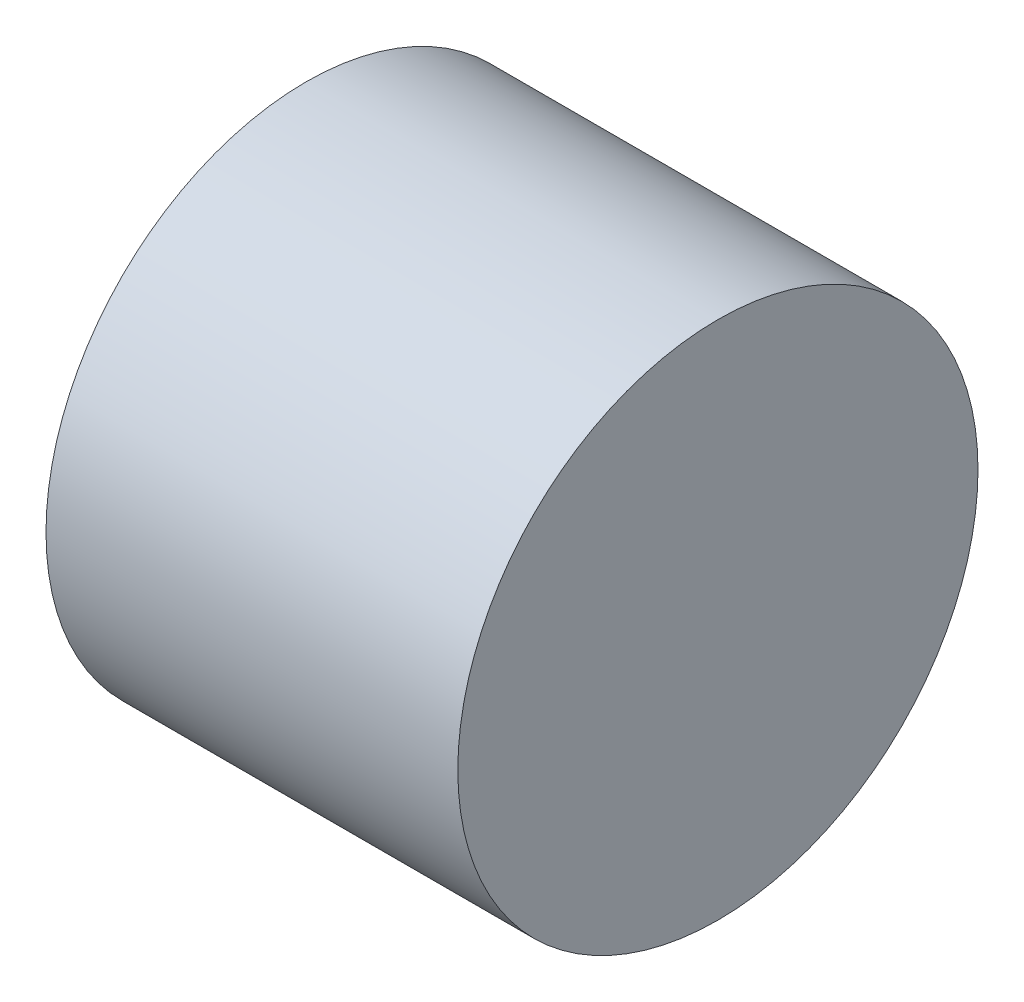
ISO-10303-21;
HEADER;
FILE_DESCRIPTION(('STEP AP214'),'2;1');
FILE_NAME('part.step','',(''),(''),'','','');
FILE_SCHEMA(('AUTOMOTIVE_DESIGN { 1 0 10303 214 1 1 1 1 }'));
ENDSEC;
DATA;
#1=APPLICATION_CONTEXT('core data for automotive mechanical design processes');
#2=APPLICATION_PROTOCOL_DEFINITION('international standard','automotive_design',2000,#1);
#3=PRODUCT_CONTEXT('',#1,'mechanical');
#4=PRODUCT('Part','Part','',(#3));
#5=PRODUCT_RELATED_PRODUCT_CATEGORY('part','',(#4));
#6=PRODUCT_DEFINITION_FORMATION('','',#4);
#7=PRODUCT_DEFINITION_CONTEXT('part definition',#1,'design');
#8=PRODUCT_DEFINITION('design','',#6,#7);
#9=PRODUCT_DEFINITION_SHAPE('','',#8);
#10=(LENGTH_UNIT() NAMED_UNIT(*) SI_UNIT(.MILLI.,.METRE.));
#11=(NAMED_UNIT(*) PLANE_ANGLE_UNIT() SI_UNIT($,.RADIAN.));
#12=(NAMED_UNIT(*) SI_UNIT($,.STERADIAN.) SOLID_ANGLE_UNIT());
#13=UNCERTAINTY_MEASURE_WITH_UNIT(LENGTH_MEASURE(1.E-05),#10,'distance_accuracy_value','');
#14=(GEOMETRIC_REPRESENTATION_CONTEXT(3) GLOBAL_UNCERTAINTY_ASSIGNED_CONTEXT((#13)) GLOBAL_UNIT_ASSIGNED_CONTEXT((#10,
#11,#12)) REPRESENTATION_CONTEXT('',''));
#15=CARTESIAN_POINT('',(0.,0.,0.));
#16=DIRECTION('',(0.,0.,1.));
#17=DIRECTION('',(1.,0.,0.));
#18=AXIS2_PLACEMENT_3D('',#15,#16,#17);
#19=CARTESIAN_POINT('',(125.4,0.,0.));
#20=DIRECTION('',(-1.,0.,0.));
#21=DIRECTION('',(0.,0.,1.));
#22=AXIS2_PLACEMENT_3D('',#19,#20,#21);
#23=CYLINDRICAL_SURFACE('',#22,152.4);
#24=CARTESIAN_POINT('',(125.4,0.,0.));
#25=DIRECTION('',(1.,0.,0.));
#26=DIRECTION('',(0.,0.,-1.));
#27=AXIS2_PLACEMENT_3D('',#24,#25,#26);
#28=CIRCLE('',#27,152.4);
#29=CARTESIAN_POINT('',(125.4,0.,-152.4));
#30=VERTEX_POINT('',#29);
#31=EDGE_CURVE('E10',#30,#30,#28,.T.);
#32=ORIENTED_EDGE('',*,*,#31,.F.);
#33=EDGE_LOOP('',(#32));
#34=FACE_BOUND('',#33,.T.);
#35=CARTESIAN_POINT('',(-115.9,0.,0.));
#36=DIRECTION('',(1.,0.,0.));
#37=DIRECTION('',(0.,0.,-1.));
#38=AXIS2_PLACEMENT_3D('',#35,#36,#37);
#39=CIRCLE('',#38,152.4);
#40=CARTESIAN_POINT('',(-115.9,0.,-152.4));
#41=VERTEX_POINT('',#40);
#42=EDGE_CURVE('E36',#41,#41,#39,.T.);
#43=ORIENTED_EDGE('',*,*,#42,.T.);
#44=EDGE_LOOP('',(#43));
#45=FACE_BOUND('',#44,.T.);
#46=ADVANCED_FACE('F33',(#34,#45),#23,.T.);
#47=CARTESIAN_POINT('',(125.4,0.,0.));
#48=DIRECTION('',(1.,0.,0.));
#49=DIRECTION('',(0.,0.,-1.));
#50=AXIS2_PLACEMENT_3D('',#47,#48,#49);
#51=PLANE('',#50);
#52=ORIENTED_EDGE('',*,*,#31,.T.);
#53=EDGE_LOOP('',(#52));
#54=FACE_BOUND('',#53,.T.);
#55=ADVANCED_FACE('F48',(#54),#51,.T.);
#56=CARTESIAN_POINT('',(-115.9,0.,0.));
#57=DIRECTION('',(1.,0.,0.));
#58=DIRECTION('',(0.,0.,-1.));
#59=AXIS2_PLACEMENT_3D('',#56,#57,#58);
#60=PLANE('',#59);
#61=ORIENTED_EDGE('',*,*,#42,.F.);
#62=EDGE_LOOP('',(#61));
#63=FACE_BOUND('',#62,.T.);
#64=ADVANCED_FACE('F46',(#63),#60,.F.);
#65=CLOSED_SHELL('',(#46,#55,#64));
#66=MANIFOLD_SOLID_BREP('B2',#65);
#67=ADVANCED_BREP_SHAPE_REPRESENTATION('',(#18,#66),#14);
#68=SHAPE_DEFINITION_REPRESENTATION(#9,#67);
ENDSEC;
END-ISO-10303-21;
